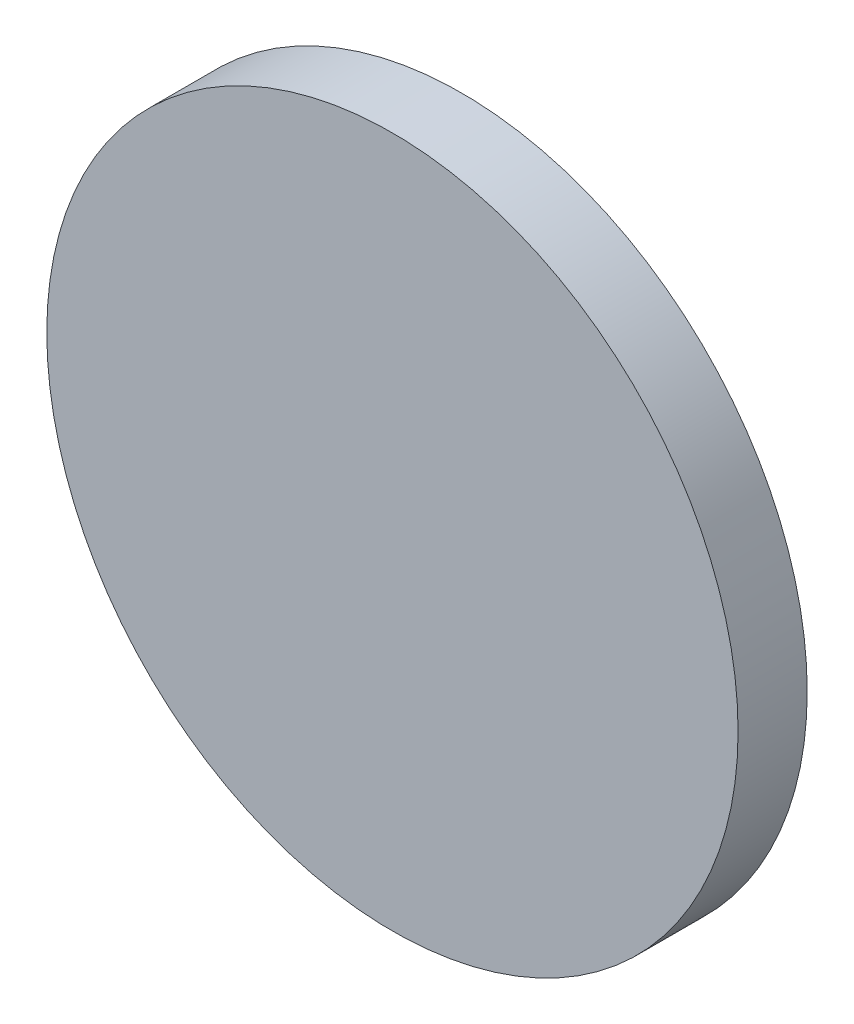
ISO-10303-21;
HEADER;
FILE_DESCRIPTION(('STEP AP214'),'2;1');
FILE_NAME('part.step','',(''),(''),'','','');
FILE_SCHEMA(('AUTOMOTIVE_DESIGN { 1 0 10303 214 1 1 1 1 }'));
ENDSEC;
DATA;
#1=APPLICATION_CONTEXT('core data for automotive mechanical design processes');
#2=APPLICATION_PROTOCOL_DEFINITION('international standard','automotive_design',2000,#1);
#3=PRODUCT_CONTEXT('',#1,'mechanical');
#4=PRODUCT('Part','Part','',(#3));
#5=PRODUCT_RELATED_PRODUCT_CATEGORY('part','',(#4));
#6=PRODUCT_DEFINITION_FORMATION('','',#4);
#7=PRODUCT_DEFINITION_CONTEXT('part definition',#1,'design');
#8=PRODUCT_DEFINITION('design','',#6,#7);
#9=PRODUCT_DEFINITION_SHAPE('','',#8);
#10=(LENGTH_UNIT() NAMED_UNIT(*) SI_UNIT(.MILLI.,.METRE.));
#11=(NAMED_UNIT(*) PLANE_ANGLE_UNIT() SI_UNIT($,.RADIAN.));
#12=(NAMED_UNIT(*) SI_UNIT($,.STERADIAN.) SOLID_ANGLE_UNIT());
#13=UNCERTAINTY_MEASURE_WITH_UNIT(LENGTH_MEASURE(1.E-05),#10,'distance_accuracy_value','');
#14=(GEOMETRIC_REPRESENTATION_CONTEXT(3) GLOBAL_UNCERTAINTY_ASSIGNED_CONTEXT((#13)) GLOBAL_UNIT_ASSIGNED_CONTEXT((#10,
#11,#12)) REPRESENTATION_CONTEXT('',''));
#15=CARTESIAN_POINT('',(0.,0.,0.));
#16=DIRECTION('',(0.,0.,1.));
#17=DIRECTION('',(1.,0.,0.));
#18=AXIS2_PLACEMENT_3D('',#15,#16,#17);
#19=CARTESIAN_POINT('',(0.,0.,2.));
#20=DIRECTION('',(0.,0.,-1.));
#21=DIRECTION('',(-1.,0.,0.));
#22=AXIS2_PLACEMENT_3D('',#19,#20,#21);
#23=CYLINDRICAL_SURFACE('',#22,10.);
#24=CARTESIAN_POINT('',(0.,0.,2.));
#25=DIRECTION('',(0.,0.,1.));
#26=DIRECTION('',(1.,0.,0.));
#27=AXIS2_PLACEMENT_3D('',#24,#25,#26);
#28=CIRCLE('',#27,10.);
#29=CARTESIAN_POINT('',(10.,0.,2.));
#30=VERTEX_POINT('',#29);
#31=EDGE_CURVE('E10',#30,#30,#28,.T.);
#32=ORIENTED_EDGE('',*,*,#31,.F.);
#33=EDGE_LOOP('',(#32));
#34=FACE_BOUND('',#33,.T.);
#35=CARTESIAN_POINT('',(0.,0.,0.));
#36=DIRECTION('',(0.,0.,1.));
#37=DIRECTION('',(1.,0.,0.));
#38=AXIS2_PLACEMENT_3D('',#35,#36,#37);
#39=CIRCLE('',#38,10.);
#40=CARTESIAN_POINT('',(10.,0.,0.));
#41=VERTEX_POINT('',#40);
#42=EDGE_CURVE('E38',#41,#41,#39,.T.);
#43=ORIENTED_EDGE('',*,*,#42,.T.);
#44=EDGE_LOOP('',(#43));
#45=FACE_BOUND('',#44,.T.);
#46=ADVANCED_FACE('F35',(#34,#45),#23,.T.);
#47=CARTESIAN_POINT('',(0.,0.,2.));
#48=DIRECTION('',(0.,0.,1.));
#49=DIRECTION('',(1.,0.,0.));
#50=AXIS2_PLACEMENT_3D('',#47,#48,#49);
#51=PLANE('',#50);
#52=ORIENTED_EDGE('',*,*,#31,.T.);
#53=EDGE_LOOP('',(#52));
#54=FACE_BOUND('',#53,.T.);
#55=ADVANCED_FACE('F50',(#54),#51,.T.);
#56=CARTESIAN_POINT('',(0.,0.,0.));
#57=DIRECTION('',(0.,0.,1.));
#58=DIRECTION('',(1.,0.,0.));
#59=AXIS2_PLACEMENT_3D('',#56,#57,#58);
#60=PLANE('',#59);
#61=ORIENTED_EDGE('',*,*,#42,.F.);
#62=EDGE_LOOP('',(#61));
#63=FACE_BOUND('',#62,.T.);
#64=ADVANCED_FACE('F48',(#63),#60,.F.);
#65=CLOSED_SHELL('',(#46,#55,#64));
#66=MANIFOLD_SOLID_BREP('B2',#65);
#67=ADVANCED_BREP_SHAPE_REPRESENTATION('',(#18,#66),#14);
#68=SHAPE_DEFINITION_REPRESENTATION(#9,#67);
ENDSEC;
END-ISO-10303-21;
